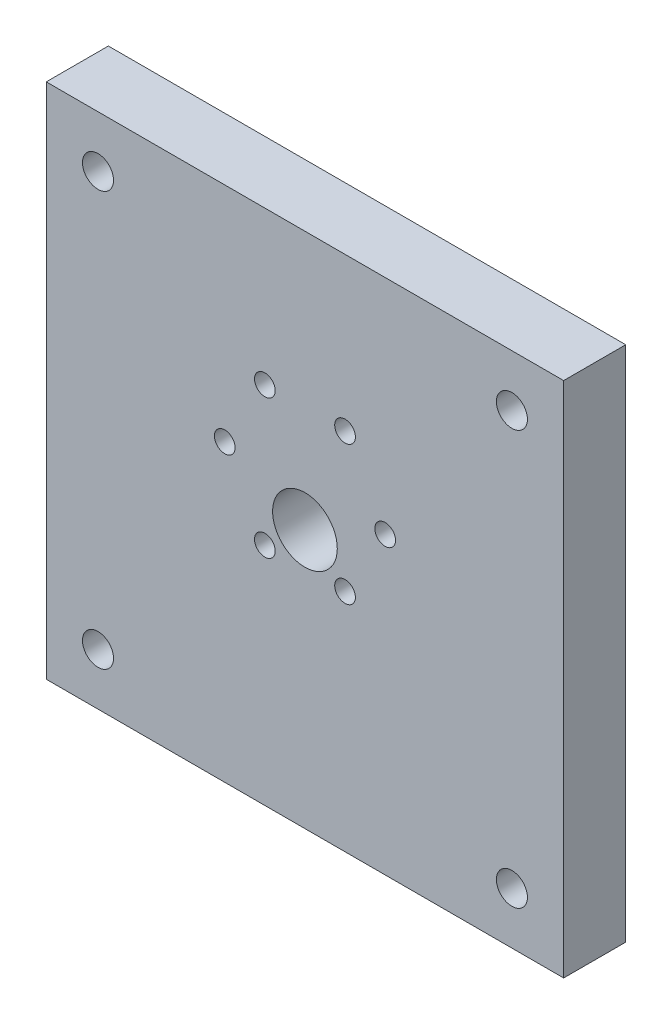
ISO-10303-21;
HEADER;
FILE_DESCRIPTION(('STEP AP214'),'2;1');
FILE_NAME('part.step','',(''),(''),'','','');
FILE_SCHEMA(('AUTOMOTIVE_DESIGN { 1 0 10303 214 1 1 1 1 }'));
ENDSEC;
DATA;
#1=APPLICATION_CONTEXT('core data for automotive mechanical design processes');
#2=APPLICATION_PROTOCOL_DEFINITION('international standard','automotive_design',2000,#1);
#3=PRODUCT_CONTEXT('',#1,'mechanical');
#4=PRODUCT('Part','Part','',(#3));
#5=PRODUCT_RELATED_PRODUCT_CATEGORY('part','',(#4));
#6=PRODUCT_DEFINITION_FORMATION('','',#4);
#7=PRODUCT_DEFINITION_CONTEXT('part definition',#1,'design');
#8=PRODUCT_DEFINITION('design','',#6,#7);
#9=PRODUCT_DEFINITION_SHAPE('','',#8);
#10=(LENGTH_UNIT() NAMED_UNIT(*) SI_UNIT(.MILLI.,.METRE.));
#11=(NAMED_UNIT(*) PLANE_ANGLE_UNIT() SI_UNIT($,.RADIAN.));
#12=(NAMED_UNIT(*) SI_UNIT($,.STERADIAN.) SOLID_ANGLE_UNIT());
#13=UNCERTAINTY_MEASURE_WITH_UNIT(LENGTH_MEASURE(1.E-05),#10,'distance_accuracy_value','');
#14=(GEOMETRIC_REPRESENTATION_CONTEXT(3) GLOBAL_UNCERTAINTY_ASSIGNED_CONTEXT((#13)) GLOBAL_UNIT_ASSIGNED_CONTEXT((#10,
#11,#12)) REPRESENTATION_CONTEXT('',''));
#15=CARTESIAN_POINT('',(0.,0.,0.));
#16=DIRECTION('',(0.,0.,1.));
#17=DIRECTION('',(1.,0.,0.));
#18=AXIS2_PLACEMENT_3D('',#15,#16,#17);
#19=CARTESIAN_POINT('',(0.,0.,12.));
#20=DIRECTION('',(0.,0.,1.));
#21=DIRECTION('',(1.,0.,0.));
#22=AXIS2_PLACEMENT_3D('',#19,#20,#21);
#23=PLANE('',#22);
#24=CARTESIAN_POINT('',(-39.9999999999992,-47.,12.));
#25=DIRECTION('',(0.,0.,1.));
#26=DIRECTION('',(1.,0.,0.));
#27=AXIS2_PLACEMENT_3D('',#24,#25,#26);
#28=CIRCLE('',#27,3.);
#29=CARTESIAN_POINT('',(-36.9999999999992,-47.,12.));
#30=VERTEX_POINT('',#29);
#31=EDGE_CURVE('E271',#30,#30,#28,.T.);
#32=ORIENTED_EDGE('',*,*,#31,.F.);
#33=EDGE_LOOP('',(#32));
#34=FACE_BOUND('',#33,.T.);
#35=CARTESIAN_POINT('',(40.0000000000008,-47.,12.));
#36=DIRECTION('',(0.,0.,1.));
#37=DIRECTION('',(1.,0.,0.));
#38=AXIS2_PLACEMENT_3D('',#35,#36,#37);
#39=CIRCLE('',#38,3.);
#40=CARTESIAN_POINT('',(43.0000000000008,-47.,12.));
#41=VERTEX_POINT('',#40);
#42=EDGE_CURVE('E275',#41,#41,#39,.T.);
#43=ORIENTED_EDGE('',*,*,#42,.F.);
#44=EDGE_LOOP('',(#43));
#45=FACE_BOUND('',#44,.T.);
#46=CARTESIAN_POINT('',(40.,33.,12.));
#47=DIRECTION('',(0.,0.,1.));
#48=DIRECTION('',(1.,0.,0.));
#49=AXIS2_PLACEMENT_3D('',#46,#47,#48);
#50=CIRCLE('',#49,3.);
#51=CARTESIAN_POINT('',(43.,33.,12.));
#52=VERTEX_POINT('',#51);
#53=EDGE_CURVE('E279',#52,#52,#50,.T.);
#54=ORIENTED_EDGE('',*,*,#53,.F.);
#55=EDGE_LOOP('',(#54));
#56=FACE_BOUND('',#55,.T.);
#57=CARTESIAN_POINT('',(-40.,33.,12.));
#58=DIRECTION('',(0.,0.,1.));
#59=DIRECTION('',(1.,0.,0.));
#60=AXIS2_PLACEMENT_3D('',#57,#58,#59);
#61=CIRCLE('',#60,3.);
#62=CARTESIAN_POINT('',(-37.,33.,12.));
#63=VERTEX_POINT('',#62);
#64=EDGE_CURVE('E266',#63,#63,#61,.T.);
#65=ORIENTED_EDGE('',*,*,#64,.F.);
#66=EDGE_LOOP('',(#65));
#67=FACE_BOUND('',#66,.T.);
#68=CARTESIAN_POINT('',(0.,-7.,12.));
#69=DIRECTION('',(0.,0.,1.));
#70=DIRECTION('',(1.,0.,0.));
#71=AXIS2_PLACEMENT_3D('',#68,#69,#70);
#72=CIRCLE('',#71,6.25);
#73=CARTESIAN_POINT('',(6.25,-7.,12.));
#74=VERTEX_POINT('',#73);
#75=EDGE_CURVE('E124',#74,#74,#72,.T.);
#76=ORIENTED_EDGE('',*,*,#75,.F.);
#77=EDGE_LOOP('',(#76));
#78=FACE_BOUND('',#77,.T.);
#79=CARTESIAN_POINT('',(-15.5,0.,12.));
#80=DIRECTION('',(0.,0.,1.));
#81=DIRECTION('',(1.,0.,0.));
#82=AXIS2_PLACEMENT_3D('',#79,#80,#81);
#83=CIRCLE('',#82,2.);
#84=CARTESIAN_POINT('',(-13.5,0.,12.));
#85=VERTEX_POINT('',#84);
#86=EDGE_CURVE('E128',#85,#85,#83,.T.);
#87=ORIENTED_EDGE('',*,*,#86,.F.);
#88=EDGE_LOOP('',(#87));
#89=FACE_BOUND('',#88,.T.);
#90=CARTESIAN_POINT('',(-7.75000000000006,-13.4233937586588,12.));
#91=DIRECTION('',(0.,0.,1.));
#92=DIRECTION('',(1.,0.,0.));
#93=AXIS2_PLACEMENT_3D('',#90,#91,#92);
#94=CIRCLE('',#93,2.);
#95=CARTESIAN_POINT('',(-5.75000000000006,-13.4233937586588,12.));
#96=VERTEX_POINT('',#95);
#97=EDGE_CURVE('E152',#96,#96,#94,.T.);
#98=ORIENTED_EDGE('',*,*,#97,.F.);
#99=EDGE_LOOP('',(#98));
#100=FACE_BOUND('',#99,.T.);
#101=CARTESIAN_POINT('',(7.74999999999997,-13.4233937586588,12.));
#102=DIRECTION('',(0.,0.,1.));
#103=DIRECTION('',(1.,0.,0.));
#104=AXIS2_PLACEMENT_3D('',#101,#102,#103);
#105=CIRCLE('',#104,2.);
#106=CARTESIAN_POINT('',(9.74999999999997,-13.4233937586588,12.));
#107=VERTEX_POINT('',#106);
#108=EDGE_CURVE('E146',#107,#107,#105,.T.);
#109=ORIENTED_EDGE('',*,*,#108,.F.);
#110=EDGE_LOOP('',(#109));
#111=FACE_BOUND('',#110,.T.);
#112=CARTESIAN_POINT('',(15.5,0.,12.));
#113=DIRECTION('',(0.,0.,1.));
#114=DIRECTION('',(1.,0.,0.));
#115=AXIS2_PLACEMENT_3D('',#112,#113,#114);
#116=CIRCLE('',#115,2.);
#117=CARTESIAN_POINT('',(17.5,0.,12.));
#118=VERTEX_POINT('',#117);
#119=EDGE_CURVE('E140',#118,#118,#116,.T.);
#120=ORIENTED_EDGE('',*,*,#119,.F.);
#121=EDGE_LOOP('',(#120));
#122=FACE_BOUND('',#121,.T.);
#123=CARTESIAN_POINT('',(7.75000000000016,13.4233937586587,12.));
#124=DIRECTION('',(0.,0.,1.));
#125=DIRECTION('',(1.,0.,0.));
#126=AXIS2_PLACEMENT_3D('',#123,#124,#125);
#127=CIRCLE('',#126,2.);
#128=CARTESIAN_POINT('',(9.75000000000016,13.4233937586587,12.));
#129=VERTEX_POINT('',#128);
#130=EDGE_CURVE('E134',#129,#129,#127,.T.);
#131=ORIENTED_EDGE('',*,*,#130,.F.);
#132=EDGE_LOOP('',(#131));
#133=FACE_BOUND('',#132,.T.);
#134=CARTESIAN_POINT('',(-7.74999999999987,13.4233937586589,12.));
#135=DIRECTION('',(0.,0.,1.));
#136=DIRECTION('',(1.,0.,0.));
#137=AXIS2_PLACEMENT_3D('',#134,#135,#136);
#138=CIRCLE('',#137,2.);
#139=CARTESIAN_POINT('',(-5.74999999999987,13.4233937586589,12.));
#140=VERTEX_POINT('',#139);
#141=EDGE_CURVE('E51',#140,#140,#138,.T.);
#142=ORIENTED_EDGE('',*,*,#141,.F.);
#143=EDGE_LOOP('',(#142));
#144=FACE_BOUND('',#143,.T.);
#145=DIRECTION('',(-1.,0.,0.));
#146=VECTOR('',#145,1.);
#147=CARTESIAN_POINT('',(50.,-57.,12.));
#148=LINE('',#147,#146);
#149=CARTESIAN_POINT('',(50.,-57.,12.));
#150=VERTEX_POINT('',#149);
#151=CARTESIAN_POINT('',(-50.,-57.,12.));
#152=VERTEX_POINT('',#151);
#153=EDGE_CURVE('E113',#150,#152,#148,.T.);
#154=ORIENTED_EDGE('',*,*,#153,.F.);
#155=DIRECTION('',(0.,-1.,0.));
#156=VECTOR('',#155,1.);
#157=CARTESIAN_POINT('',(50.,43.,12.));
#158=LINE('',#157,#156);
#159=CARTESIAN_POINT('',(50.,43.,12.));
#160=VERTEX_POINT('',#159);
#161=EDGE_CURVE('E83',#160,#150,#158,.T.);
#162=ORIENTED_EDGE('',*,*,#161,.F.);
#163=DIRECTION('',(-1.,0.,0.));
#164=VECTOR('',#163,1.);
#165=CARTESIAN_POINT('',(50.,43.,12.));
#166=LINE('',#165,#164);
#167=CARTESIAN_POINT('',(-50.,43.,12.));
#168=VERTEX_POINT('',#167);
#169=EDGE_CURVE('E118',#160,#168,#166,.T.);
#170=ORIENTED_EDGE('',*,*,#169,.T.);
#171=DIRECTION('',(0.,-1.,0.));
#172=VECTOR('',#171,1.);
#173=CARTESIAN_POINT('',(-50.,43.,12.));
#174=LINE('',#173,#172);
#175=EDGE_CURVE('E98',#168,#152,#174,.T.);
#176=ORIENTED_EDGE('',*,*,#175,.T.);
#177=EDGE_LOOP('',(#154,#162,#170,#176));
#178=FACE_BOUND('',#177,.T.);
#179=ADVANCED_FACE('F47',(#34,#45,#56,#67,#78,#89,#100,#111,#122,#133,#144,#178),#23,.T.);
#180=CARTESIAN_POINT('',(0.,0.,0.));
#181=DIRECTION('',(0.,0.,1.));
#182=DIRECTION('',(1.,0.,0.));
#183=AXIS2_PLACEMENT_3D('',#180,#181,#182);
#184=PLANE('',#183);
#185=CARTESIAN_POINT('',(-39.9999999999992,-47.,0.));
#186=DIRECTION('',(0.,0.,1.));
#187=DIRECTION('',(1.,0.,0.));
#188=AXIS2_PLACEMENT_3D('',#185,#186,#187);
#189=CIRCLE('',#188,3.);
#190=CARTESIAN_POINT('',(-36.9999999999992,-47.,0.));
#191=VERTEX_POINT('',#190);
#192=EDGE_CURVE('E236',#191,#191,#189,.T.);
#193=ORIENTED_EDGE('',*,*,#192,.T.);
#194=EDGE_LOOP('',(#193));
#195=FACE_BOUND('',#194,.T.);
#196=CARTESIAN_POINT('',(40.0000000000008,-47.,0.));
#197=DIRECTION('',(0.,0.,1.));
#198=DIRECTION('',(1.,0.,0.));
#199=AXIS2_PLACEMENT_3D('',#196,#197,#198);
#200=CIRCLE('',#199,3.);
#201=CARTESIAN_POINT('',(43.0000000000008,-47.,0.));
#202=VERTEX_POINT('',#201);
#203=EDGE_CURVE('E240',#202,#202,#200,.T.);
#204=ORIENTED_EDGE('',*,*,#203,.T.);
#205=EDGE_LOOP('',(#204));
#206=FACE_BOUND('',#205,.T.);
#207=CARTESIAN_POINT('',(40.,33.,0.));
#208=DIRECTION('',(0.,0.,1.));
#209=DIRECTION('',(1.,0.,0.));
#210=AXIS2_PLACEMENT_3D('',#207,#208,#209);
#211=CIRCLE('',#210,3.);
#212=CARTESIAN_POINT('',(43.,33.,0.));
#213=VERTEX_POINT('',#212);
#214=EDGE_CURVE('E244',#213,#213,#211,.T.);
#215=ORIENTED_EDGE('',*,*,#214,.T.);
#216=EDGE_LOOP('',(#215));
#217=FACE_BOUND('',#216,.T.);
#218=CARTESIAN_POINT('',(-40.,33.,0.));
#219=DIRECTION('',(0.,0.,1.));
#220=DIRECTION('',(1.,0.,0.));
#221=AXIS2_PLACEMENT_3D('',#218,#219,#220);
#222=CIRCLE('',#221,3.);
#223=CARTESIAN_POINT('',(-37.,33.,0.));
#224=VERTEX_POINT('',#223);
#225=EDGE_CURVE('E116',#224,#224,#222,.T.);
#226=ORIENTED_EDGE('',*,*,#225,.T.);
#227=EDGE_LOOP('',(#226));
#228=FACE_BOUND('',#227,.T.);
#229=CARTESIAN_POINT('',(0.,-7.,0.));
#230=DIRECTION('',(0.,0.,1.));
#231=DIRECTION('',(1.,0.,0.));
#232=AXIS2_PLACEMENT_3D('',#229,#230,#231);
#233=CIRCLE('',#232,6.25);
#234=CARTESIAN_POINT('',(6.25,-7.,0.));
#235=VERTEX_POINT('',#234);
#236=EDGE_CURVE('E125',#235,#235,#233,.T.);
#237=ORIENTED_EDGE('',*,*,#236,.T.);
#238=EDGE_LOOP('',(#237));
#239=FACE_BOUND('',#238,.T.);
#240=CARTESIAN_POINT('',(-15.5,0.,0.));
#241=DIRECTION('',(0.,0.,1.));
#242=DIRECTION('',(1.,0.,0.));
#243=AXIS2_PLACEMENT_3D('',#240,#241,#242);
#244=CIRCLE('',#243,2.);
#245=CARTESIAN_POINT('',(-13.5,0.,0.));
#246=VERTEX_POINT('',#245);
#247=EDGE_CURVE('E155',#246,#246,#244,.T.);
#248=ORIENTED_EDGE('',*,*,#247,.T.);
#249=EDGE_LOOP('',(#248));
#250=FACE_BOUND('',#249,.T.);
#251=CARTESIAN_POINT('',(-7.75000000000006,-13.4233937586588,0.));
#252=DIRECTION('',(0.,0.,1.));
#253=DIRECTION('',(1.,0.,0.));
#254=AXIS2_PLACEMENT_3D('',#251,#252,#253);
#255=CIRCLE('',#254,2.);
#256=CARTESIAN_POINT('',(-5.75000000000006,-13.4233937586588,0.));
#257=VERTEX_POINT('',#256);
#258=EDGE_CURVE('E149',#257,#257,#255,.T.);
#259=ORIENTED_EDGE('',*,*,#258,.T.);
#260=EDGE_LOOP('',(#259));
#261=FACE_BOUND('',#260,.T.);
#262=CARTESIAN_POINT('',(7.74999999999997,-13.4233937586588,0.));
#263=DIRECTION('',(0.,0.,1.));
#264=DIRECTION('',(1.,0.,0.));
#265=AXIS2_PLACEMENT_3D('',#262,#263,#264);
#266=CIRCLE('',#265,2.);
#267=CARTESIAN_POINT('',(9.74999999999997,-13.4233937586588,0.));
#268=VERTEX_POINT('',#267);
#269=EDGE_CURVE('E143',#268,#268,#266,.T.);
#270=ORIENTED_EDGE('',*,*,#269,.T.);
#271=EDGE_LOOP('',(#270));
#272=FACE_BOUND('',#271,.T.);
#273=CARTESIAN_POINT('',(15.5,0.,0.));
#274=DIRECTION('',(0.,0.,1.));
#275=DIRECTION('',(1.,0.,0.));
#276=AXIS2_PLACEMENT_3D('',#273,#274,#275);
#277=CIRCLE('',#276,2.);
#278=CARTESIAN_POINT('',(17.5,0.,0.));
#279=VERTEX_POINT('',#278);
#280=EDGE_CURVE('E137',#279,#279,#277,.T.);
#281=ORIENTED_EDGE('',*,*,#280,.T.);
#282=EDGE_LOOP('',(#281));
#283=FACE_BOUND('',#282,.T.);
#284=CARTESIAN_POINT('',(7.75000000000016,13.4233937586587,0.));
#285=DIRECTION('',(0.,0.,1.));
#286=DIRECTION('',(1.,0.,0.));
#287=AXIS2_PLACEMENT_3D('',#284,#285,#286);
#288=CIRCLE('',#287,2.);
#289=CARTESIAN_POINT('',(9.75000000000016,13.4233937586587,0.));
#290=VERTEX_POINT('',#289);
#291=EDGE_CURVE('E131',#290,#290,#288,.T.);
#292=ORIENTED_EDGE('',*,*,#291,.T.);
#293=EDGE_LOOP('',(#292));
#294=FACE_BOUND('',#293,.T.);
#295=CARTESIAN_POINT('',(-7.74999999999987,13.4233937586589,0.));
#296=DIRECTION('',(0.,0.,1.));
#297=DIRECTION('',(1.,0.,0.));
#298=AXIS2_PLACEMENT_3D('',#295,#296,#297);
#299=CIRCLE('',#298,2.);
#300=CARTESIAN_POINT('',(-5.74999999999987,13.4233937586589,0.));
#301=VERTEX_POINT('',#300);
#302=EDGE_CURVE('E12',#301,#301,#299,.T.);
#303=ORIENTED_EDGE('',*,*,#302,.T.);
#304=EDGE_LOOP('',(#303));
#305=FACE_BOUND('',#304,.T.);
#306=DIRECTION('',(-1.,0.,0.));
#307=VECTOR('',#306,1.);
#308=CARTESIAN_POINT('',(50.,-57.,0.));
#309=LINE('',#308,#307);
#310=CARTESIAN_POINT('',(50.,-57.,0.));
#311=VERTEX_POINT('',#310);
#312=CARTESIAN_POINT('',(-50.,-57.,0.));
#313=VERTEX_POINT('',#312);
#314=EDGE_CURVE('E88',#311,#313,#309,.T.);
#315=ORIENTED_EDGE('',*,*,#314,.T.);
#316=DIRECTION('',(0.,-1.,0.));
#317=VECTOR('',#316,1.);
#318=CARTESIAN_POINT('',(-50.,43.,0.));
#319=LINE('',#318,#317);
#320=CARTESIAN_POINT('',(-50.,43.,0.));
#321=VERTEX_POINT('',#320);
#322=EDGE_CURVE('E96',#321,#313,#319,.T.);
#323=ORIENTED_EDGE('',*,*,#322,.F.);
#324=DIRECTION('',(-1.,0.,0.));
#325=VECTOR('',#324,1.);
#326=CARTESIAN_POINT('',(50.,43.,0.));
#327=LINE('',#326,#325);
#328=CARTESIAN_POINT('',(50.,43.,0.));
#329=VERTEX_POINT('',#328);
#330=EDGE_CURVE('E105',#329,#321,#327,.T.);
#331=ORIENTED_EDGE('',*,*,#330,.F.);
#332=DIRECTION('',(0.,-1.,0.));
#333=VECTOR('',#332,1.);
#334=CARTESIAN_POINT('',(50.,43.,0.));
#335=LINE('',#334,#333);
#336=EDGE_CURVE('E64',#329,#311,#335,.T.);
#337=ORIENTED_EDGE('',*,*,#336,.T.);
#338=EDGE_LOOP('',(#315,#323,#331,#337));
#339=FACE_BOUND('',#338,.T.);
#340=ADVANCED_FACE('F49',(#195,#206,#217,#228,#239,#250,#261,#272,#283,#294,#305,#339),#184,.F.);
#341=CARTESIAN_POINT('',(-7.74999999999987,13.4233937586589,0.));
#342=DIRECTION('',(0.,0.,1.));
#343=DIRECTION('',(1.,0.,0.));
#344=AXIS2_PLACEMENT_3D('',#341,#342,#343);
#345=CYLINDRICAL_SURFACE('',#344,2.);
#346=ORIENTED_EDGE('',*,*,#302,.F.);
#347=EDGE_LOOP('',(#346));
#348=FACE_BOUND('',#347,.T.);
#349=ORIENTED_EDGE('',*,*,#141,.T.);
#350=EDGE_LOOP('',(#349));
#351=FACE_BOUND('',#350,.T.);
#352=ADVANCED_FACE('F206',(#348,#351),#345,.F.);
#353=CARTESIAN_POINT('',(7.75000000000016,13.4233937586587,0.));
#354=DIRECTION('',(0.,0.,1.));
#355=DIRECTION('',(1.,0.,0.));
#356=AXIS2_PLACEMENT_3D('',#353,#354,#355);
#357=CYLINDRICAL_SURFACE('',#356,2.);
#358=ORIENTED_EDGE('',*,*,#291,.F.);
#359=EDGE_LOOP('',(#358));
#360=FACE_BOUND('',#359,.T.);
#361=ORIENTED_EDGE('',*,*,#130,.T.);
#362=EDGE_LOOP('',(#361));
#363=FACE_BOUND('',#362,.T.);
#364=ADVANCED_FACE('F202',(#360,#363),#357,.F.);
#365=CARTESIAN_POINT('',(15.5,0.,0.));
#366=DIRECTION('',(0.,0.,1.));
#367=DIRECTION('',(1.,0.,0.));
#368=AXIS2_PLACEMENT_3D('',#365,#366,#367);
#369=CYLINDRICAL_SURFACE('',#368,2.);
#370=ORIENTED_EDGE('',*,*,#280,.F.);
#371=EDGE_LOOP('',(#370));
#372=FACE_BOUND('',#371,.T.);
#373=ORIENTED_EDGE('',*,*,#119,.T.);
#374=EDGE_LOOP('',(#373));
#375=FACE_BOUND('',#374,.T.);
#376=ADVANCED_FACE('F205',(#372,#375),#369,.F.);
#377=CARTESIAN_POINT('',(7.74999999999997,-13.4233937586588,0.));
#378=DIRECTION('',(0.,0.,1.));
#379=DIRECTION('',(1.,0.,0.));
#380=AXIS2_PLACEMENT_3D('',#377,#378,#379);
#381=CYLINDRICAL_SURFACE('',#380,2.);
#382=ORIENTED_EDGE('',*,*,#269,.F.);
#383=EDGE_LOOP('',(#382));
#384=FACE_BOUND('',#383,.T.);
#385=ORIENTED_EDGE('',*,*,#108,.T.);
#386=EDGE_LOOP('',(#385));
#387=FACE_BOUND('',#386,.T.);
#388=ADVANCED_FACE('F210',(#384,#387),#381,.F.);
#389=CARTESIAN_POINT('',(-7.75000000000006,-13.4233937586588,0.));
#390=DIRECTION('',(0.,0.,1.));
#391=DIRECTION('',(1.,0.,0.));
#392=AXIS2_PLACEMENT_3D('',#389,#390,#391);
#393=CYLINDRICAL_SURFACE('',#392,2.);
#394=ORIENTED_EDGE('',*,*,#258,.F.);
#395=EDGE_LOOP('',(#394));
#396=FACE_BOUND('',#395,.T.);
#397=ORIENTED_EDGE('',*,*,#97,.T.);
#398=EDGE_LOOP('',(#397));
#399=FACE_BOUND('',#398,.T.);
#400=ADVANCED_FACE('F214',(#396,#399),#393,.F.);
#401=CARTESIAN_POINT('',(-15.5,0.,0.));
#402=DIRECTION('',(0.,0.,1.));
#403=DIRECTION('',(1.,0.,0.));
#404=AXIS2_PLACEMENT_3D('',#401,#402,#403);
#405=CYLINDRICAL_SURFACE('',#404,2.);
#406=ORIENTED_EDGE('',*,*,#247,.F.);
#407=EDGE_LOOP('',(#406));
#408=FACE_BOUND('',#407,.T.);
#409=ORIENTED_EDGE('',*,*,#86,.T.);
#410=EDGE_LOOP('',(#409));
#411=FACE_BOUND('',#410,.T.);
#412=ADVANCED_FACE('F161',(#408,#411),#405,.F.);
#413=CARTESIAN_POINT('',(0.,-7.,0.));
#414=DIRECTION('',(0.,0.,1.));
#415=DIRECTION('',(1.,0.,0.));
#416=AXIS2_PLACEMENT_3D('',#413,#414,#415);
#417=CYLINDRICAL_SURFACE('',#416,6.25);
#418=ORIENTED_EDGE('',*,*,#236,.F.);
#419=EDGE_LOOP('',(#418));
#420=FACE_BOUND('',#419,.T.);
#421=ORIENTED_EDGE('',*,*,#75,.T.);
#422=EDGE_LOOP('',(#421));
#423=FACE_BOUND('',#422,.T.);
#424=ADVANCED_FACE('F198',(#420,#423),#417,.F.);
#425=CARTESIAN_POINT('',(50.,-57.,0.));
#426=DIRECTION('',(0.,1.,0.));
#427=DIRECTION('',(-1.,0.,0.));
#428=AXIS2_PLACEMENT_3D('',#425,#426,#427);
#429=PLANE('',#428);
#430=ORIENTED_EDGE('',*,*,#153,.T.);
#431=DIRECTION('',(0.,0.,1.));
#432=VECTOR('',#431,1.);
#433=CARTESIAN_POINT('',(-50.,-57.,0.));
#434=LINE('',#433,#432);
#435=EDGE_CURVE('E103',#313,#152,#434,.T.);
#436=ORIENTED_EDGE('',*,*,#435,.F.);
#437=ORIENTED_EDGE('',*,*,#314,.F.);
#438=DIRECTION('',(0.,0.,1.));
#439=VECTOR('',#438,1.);
#440=CARTESIAN_POINT('',(50.,-57.,0.));
#441=LINE('',#440,#439);
#442=EDGE_CURVE('E109',#311,#150,#441,.T.);
#443=ORIENTED_EDGE('',*,*,#442,.T.);
#444=EDGE_LOOP('',(#430,#436,#437,#443));
#445=FACE_BOUND('',#444,.T.);
#446=ADVANCED_FACE('F179',(#445),#429,.F.);
#447=CARTESIAN_POINT('',(-50.,43.,0.));
#448=DIRECTION('',(-1.,0.,0.));
#449=DIRECTION('',(0.,-1.,0.));
#450=AXIS2_PLACEMENT_3D('',#447,#448,#449);
#451=PLANE('',#450);
#452=ORIENTED_EDGE('',*,*,#175,.F.);
#453=DIRECTION('',(0.,0.,1.));
#454=VECTOR('',#453,1.);
#455=CARTESIAN_POINT('',(-50.,43.,0.));
#456=LINE('',#455,#454);
#457=EDGE_CURVE('E94',#321,#168,#456,.T.);
#458=ORIENTED_EDGE('',*,*,#457,.F.);
#459=ORIENTED_EDGE('',*,*,#322,.T.);
#460=ORIENTED_EDGE('',*,*,#435,.T.);
#461=EDGE_LOOP('',(#452,#458,#459,#460));
#462=FACE_BOUND('',#461,.T.);
#463=ADVANCED_FACE('F95',(#462),#451,.T.);
#464=CARTESIAN_POINT('',(50.,43.,0.));
#465=DIRECTION('',(0.,1.,0.));
#466=DIRECTION('',(-1.,0.,0.));
#467=AXIS2_PLACEMENT_3D('',#464,#465,#466);
#468=PLANE('',#467);
#469=ORIENTED_EDGE('',*,*,#169,.F.);
#470=DIRECTION('',(0.,0.,1.));
#471=VECTOR('',#470,1.);
#472=CARTESIAN_POINT('',(50.,43.,0.));
#473=LINE('',#472,#471);
#474=EDGE_CURVE('E80',#329,#160,#473,.T.);
#475=ORIENTED_EDGE('',*,*,#474,.F.);
#476=ORIENTED_EDGE('',*,*,#330,.T.);
#477=ORIENTED_EDGE('',*,*,#457,.T.);
#478=EDGE_LOOP('',(#469,#475,#476,#477));
#479=FACE_BOUND('',#478,.T.);
#480=ADVANCED_FACE('F107',(#479),#468,.T.);
#481=CARTESIAN_POINT('',(50.,43.,0.));
#482=DIRECTION('',(-1.,0.,0.));
#483=DIRECTION('',(0.,-1.,0.));
#484=AXIS2_PLACEMENT_3D('',#481,#482,#483);
#485=PLANE('',#484);
#486=ORIENTED_EDGE('',*,*,#161,.T.);
#487=ORIENTED_EDGE('',*,*,#442,.F.);
#488=ORIENTED_EDGE('',*,*,#336,.F.);
#489=ORIENTED_EDGE('',*,*,#474,.T.);
#490=EDGE_LOOP('',(#486,#487,#488,#489));
#491=FACE_BOUND('',#490,.T.);
#492=ADVANCED_FACE('F180',(#491),#485,.F.);
#493=CARTESIAN_POINT('',(-40.,33.,0.));
#494=DIRECTION('',(0.,0.,1.));
#495=DIRECTION('',(1.,0.,0.));
#496=AXIS2_PLACEMENT_3D('',#493,#494,#495);
#497=CYLINDRICAL_SURFACE('',#496,3.);
#498=ORIENTED_EDGE('',*,*,#225,.F.);
#499=EDGE_LOOP('',(#498));
#500=FACE_BOUND('',#499,.T.);
#501=ORIENTED_EDGE('',*,*,#64,.T.);
#502=EDGE_LOOP('',(#501));
#503=FACE_BOUND('',#502,.T.);
#504=ADVANCED_FACE('F182',(#500,#503),#497,.F.);
#505=CARTESIAN_POINT('',(40.,33.,0.));
#506=DIRECTION('',(0.,0.,1.));
#507=DIRECTION('',(1.,0.,0.));
#508=AXIS2_PLACEMENT_3D('',#505,#506,#507);
#509=CYLINDRICAL_SURFACE('',#508,3.);
#510=ORIENTED_EDGE('',*,*,#214,.F.);
#511=EDGE_LOOP('',(#510));
#512=FACE_BOUND('',#511,.T.);
#513=ORIENTED_EDGE('',*,*,#53,.T.);
#514=EDGE_LOOP('',(#513));
#515=FACE_BOUND('',#514,.T.);
#516=ADVANCED_FACE('F188',(#512,#515),#509,.F.);
#517=CARTESIAN_POINT('',(40.0000000000008,-47.,0.));
#518=DIRECTION('',(0.,0.,1.));
#519=DIRECTION('',(1.,0.,0.));
#520=AXIS2_PLACEMENT_3D('',#517,#518,#519);
#521=CYLINDRICAL_SURFACE('',#520,3.);
#522=ORIENTED_EDGE('',*,*,#203,.F.);
#523=EDGE_LOOP('',(#522));
#524=FACE_BOUND('',#523,.T.);
#525=ORIENTED_EDGE('',*,*,#42,.T.);
#526=EDGE_LOOP('',(#525));
#527=FACE_BOUND('',#526,.T.);
#528=ADVANCED_FACE('F289',(#524,#527),#521,.F.);
#529=CARTESIAN_POINT('',(-39.9999999999992,-47.,0.));
#530=DIRECTION('',(0.,0.,1.));
#531=DIRECTION('',(1.,0.,0.));
#532=AXIS2_PLACEMENT_3D('',#529,#530,#531);
#533=CYLINDRICAL_SURFACE('',#532,3.);
#534=ORIENTED_EDGE('',*,*,#192,.F.);
#535=EDGE_LOOP('',(#534));
#536=FACE_BOUND('',#535,.T.);
#537=ORIENTED_EDGE('',*,*,#31,.T.);
#538=EDGE_LOOP('',(#537));
#539=FACE_BOUND('',#538,.T.);
#540=ADVANCED_FACE('F295',(#536,#539),#533,.F.);
#541=CLOSED_SHELL('',(#179,#340,#352,#364,#376,#388,#400,#412,#424,#446,#463,#480,#492,#504,
#516,#528,#540));
#542=MANIFOLD_SOLID_BREP('B2',#541);
#543=ADVANCED_BREP_SHAPE_REPRESENTATION('',(#18,#542),#14);
#544=SHAPE_DEFINITION_REPRESENTATION(#9,#543);
ENDSEC;
END-ISO-10303-21;
